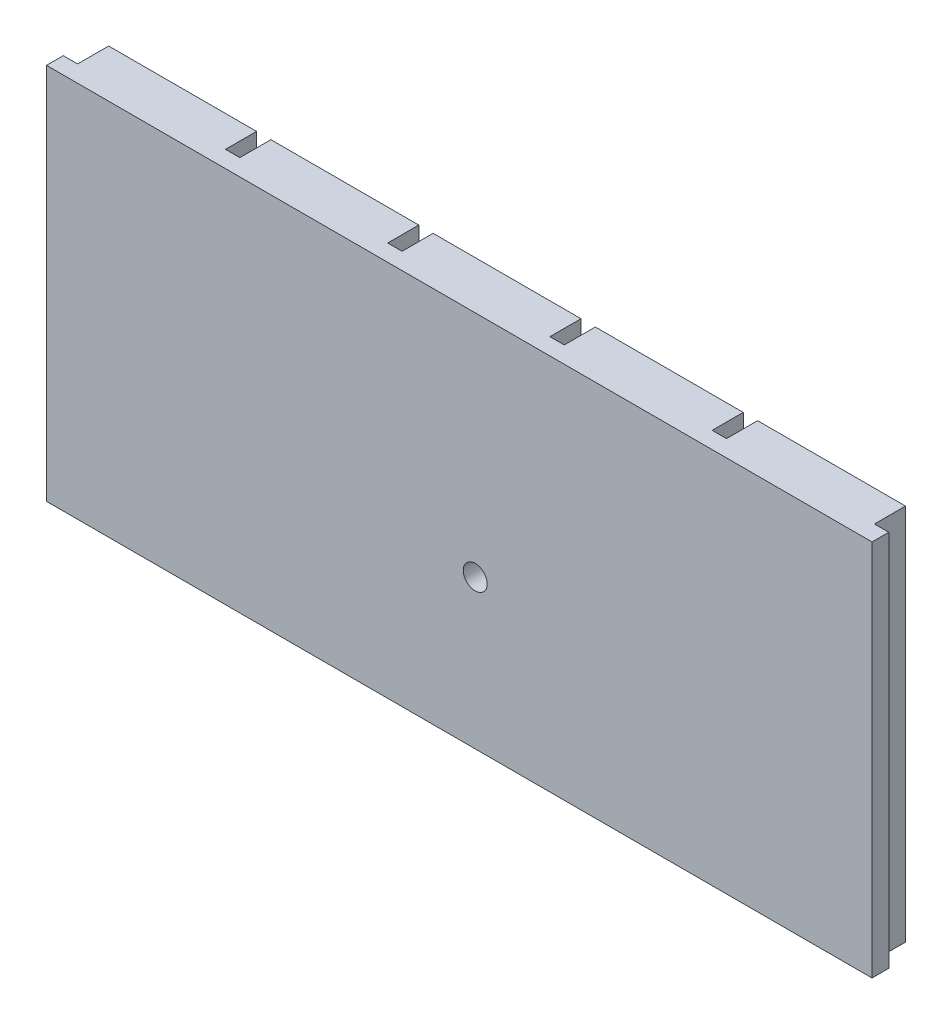
ISO-10303-21;
HEADER;
FILE_DESCRIPTION(('STEP AP214'),'2;1');
FILE_NAME('part.step','',(''),(''),'','','');
FILE_SCHEMA(('AUTOMOTIVE_DESIGN { 1 0 10303 214 1 1 1 1 }'));
ENDSEC;
DATA;
#1=APPLICATION_CONTEXT('core data for automotive mechanical design processes');
#2=APPLICATION_PROTOCOL_DEFINITION('international standard','automotive_design',2000,#1);
#3=PRODUCT_CONTEXT('',#1,'mechanical');
#4=PRODUCT('Part','Part','',(#3));
#5=PRODUCT_RELATED_PRODUCT_CATEGORY('part','',(#4));
#6=PRODUCT_DEFINITION_FORMATION('','',#4);
#7=PRODUCT_DEFINITION_CONTEXT('part definition',#1,'design');
#8=PRODUCT_DEFINITION('design','',#6,#7);
#9=PRODUCT_DEFINITION_SHAPE('','',#8);
#10=(LENGTH_UNIT() NAMED_UNIT(*) SI_UNIT(.MILLI.,.METRE.));
#11=(NAMED_UNIT(*) PLANE_ANGLE_UNIT() SI_UNIT($,.RADIAN.));
#12=(NAMED_UNIT(*) SI_UNIT($,.STERADIAN.) SOLID_ANGLE_UNIT());
#13=UNCERTAINTY_MEASURE_WITH_UNIT(LENGTH_MEASURE(1.E-05),#10,'distance_accuracy_value','');
#14=(GEOMETRIC_REPRESENTATION_CONTEXT(3) GLOBAL_UNCERTAINTY_ASSIGNED_CONTEXT((#13)) GLOBAL_UNIT_ASSIGNED_CONTEXT((#10,
#11,#12)) REPRESENTATION_CONTEXT('',''));
#15=CARTESIAN_POINT('',(0.,0.,0.));
#16=DIRECTION('',(0.,0.,1.));
#17=DIRECTION('',(1.,0.,0.));
#18=AXIS2_PLACEMENT_3D('',#15,#16,#17);
#19=CARTESIAN_POINT('',(0.,0.,0.));
#20=DIRECTION('',(0.,0.,-1.));
#21=DIRECTION('',(-1.,0.,0.));
#22=AXIS2_PLACEMENT_3D('',#19,#20,#21);
#23=PLANE('',#22);
#24=DIRECTION('',(0.,1.,0.));
#25=VECTOR('',#24,1.);
#26=CARTESIAN_POINT('',(-49.4064909033683,-39.501,9.47941669413857E-13));
#27=LINE('',#26,#25);
#28=CARTESIAN_POINT('',(-49.4064909033683,-39.4999999999999,9.47941669413857E-13));
#29=VERTEX_POINT('',#28);
#30=CARTESIAN_POINT('',(-49.4064909033683,39.4999999999999,9.47941669413857E-13));
#31=VERTEX_POINT('',#30);
#32=EDGE_CURVE('E342',#29,#31,#27,.T.);
#33=ORIENTED_EDGE('',*,*,#32,.T.);
#34=DIRECTION('',(-1.,0.,0.));
#35=VECTOR('',#34,1.);
#36=CARTESIAN_POINT('',(-86.3441515056138,39.4999999999999,0.));
#37=LINE('',#36,#35);
#38=CARTESIAN_POINT('',(-18.4688303011228,39.4999999999999,7.11507343120009E-13));
#39=VERTEX_POINT('',#38);
#40=EDGE_CURVE('E377',#39,#31,#37,.T.);
#41=ORIENTED_EDGE('',*,*,#40,.F.);
#42=DIRECTION('',(0.,1.,0.));
#43=VECTOR('',#42,1.);
#44=CARTESIAN_POINT('',(-18.4688303011228,-39.501,7.11507343120009E-13));
#45=LINE('',#44,#43);
#46=CARTESIAN_POINT('',(-18.4688303011228,-39.4999999999999,0.));
#47=VERTEX_POINT('',#46);
#48=EDGE_CURVE('E318',#47,#39,#45,.T.);
#49=ORIENTED_EDGE('',*,*,#48,.F.);
#50=DIRECTION('',(1.,0.,0.));
#51=VECTOR('',#50,1.);
#52=CARTESIAN_POINT('',(-86.3441515056138,-39.4999999999999,0.));
#53=LINE('',#52,#51);
#54=EDGE_CURVE('E228',#29,#47,#53,.T.);
#55=ORIENTED_EDGE('',*,*,#54,.F.);
#56=EDGE_LOOP('',(#33,#41,#49,#55));
#57=FACE_BOUND('',#56,.T.);
#58=ADVANCED_FACE('F35',(#57),#23,.T.);
#59=DIRECTION('',(0.,1.,0.));
#60=VECTOR('',#59,1.);
#61=CARTESIAN_POINT('',(-15.4688303011228,-39.501,7.10956252060392E-13));
#62=LINE('',#61,#60);
#63=CARTESIAN_POINT('',(-15.4688303011228,-39.4999999999999,7.10956252060392E-13));
#64=VERTEX_POINT('',#63);
#65=CARTESIAN_POINT('',(-15.4688303011228,39.4999999999999,7.10956252060392E-13));
#66=VERTEX_POINT('',#65);
#67=EDGE_CURVE('E317',#64,#66,#62,.T.);
#68=ORIENTED_EDGE('',*,*,#67,.T.);
#69=CARTESIAN_POINT('',(15.4688303011228,39.4999999999999,4.74521925766545E-13));
#70=VERTEX_POINT('',#69);
#71=EDGE_CURVE('E379',#70,#66,#37,.T.);
#72=ORIENTED_EDGE('',*,*,#71,.F.);
#73=DIRECTION('',(0.,1.,0.));
#74=VECTOR('',#73,1.);
#75=CARTESIAN_POINT('',(15.4688303011228,-39.501,4.74521925766545E-13));
#76=LINE('',#75,#74);
#77=CARTESIAN_POINT('',(15.4688303011228,-39.4999999999999,0.));
#78=VERTEX_POINT('',#77);
#79=EDGE_CURVE('E293',#78,#70,#76,.T.);
#80=ORIENTED_EDGE('',*,*,#79,.F.);
#81=EDGE_CURVE('E416',#64,#78,#53,.T.);
#82=ORIENTED_EDGE('',*,*,#81,.F.);
#83=EDGE_LOOP('',(#68,#72,#80,#82));
#84=FACE_BOUND('',#83,.T.);
#85=CARTESIAN_POINT('',(3.3372047050014,-8.38677821628897,0.));
#86=DIRECTION('',(0.,0.,1.));
#87=DIRECTION('',(1.,0.,0.));
#88=AXIS2_PLACEMENT_3D('',#85,#86,#87);
#89=CIRCLE('',#88,2.5);
#90=CARTESIAN_POINT('',(5.8372047050014,-8.38677821628897,0.));
#91=VERTEX_POINT('',#90);
#92=EDGE_CURVE('E241',#91,#91,#89,.T.);
#93=ORIENTED_EDGE('',*,*,#92,.T.);
#94=EDGE_LOOP('',(#93));
#95=FACE_BOUND('',#94,.T.);
#96=ADVANCED_FACE('F413',(#84,#95),#23,.T.);
#97=DIRECTION('',(0.,1.,0.));
#98=VECTOR('',#97,1.);
#99=CARTESIAN_POINT('',(18.4688303011228,-39.501,4.73970834706928E-13));
#100=LINE('',#99,#98);
#101=CARTESIAN_POINT('',(18.4688303011228,-39.4999999999999,4.73970834706928E-13));
#102=VERTEX_POINT('',#101);
#103=CARTESIAN_POINT('',(18.4688303011228,39.4999999999999,4.73970834706928E-13));
#104=VERTEX_POINT('',#103);
#105=EDGE_CURVE('E292',#102,#104,#100,.T.);
#106=ORIENTED_EDGE('',*,*,#105,.T.);
#107=CARTESIAN_POINT('',(49.4064909033683,39.4999999999999,2.3753650841308E-13));
#108=VERTEX_POINT('',#107);
#109=EDGE_CURVE('E233',#108,#104,#37,.T.);
#110=ORIENTED_EDGE('',*,*,#109,.F.);
#111=DIRECTION('',(0.,1.,0.));
#112=VECTOR('',#111,1.);
#113=CARTESIAN_POINT('',(49.4064909033683,-39.501,2.3753650841308E-13));
#114=LINE('',#113,#112);
#115=CARTESIAN_POINT('',(49.4064909033683,-39.4999999999999,0.));
#116=VERTEX_POINT('',#115);
#117=EDGE_CURVE('E268',#116,#108,#114,.T.);
#118=ORIENTED_EDGE('',*,*,#117,.F.);
#119=EDGE_CURVE('E397',#102,#116,#53,.T.);
#120=ORIENTED_EDGE('',*,*,#119,.F.);
#121=EDGE_LOOP('',(#106,#110,#118,#120));
#122=FACE_BOUND('',#121,.T.);
#123=ADVANCED_FACE('F395',(#122),#23,.T.);
#124=DIRECTION('',(0.,1.,0.));
#125=VECTOR('',#124,1.);
#126=CARTESIAN_POINT('',(52.4064909033683,-39.501,2.36985417353464E-13));
#127=LINE('',#126,#125);
#128=CARTESIAN_POINT('',(52.4064909033683,-39.4999999999999,2.36985417353464E-13));
#129=VERTEX_POINT('',#128);
#130=CARTESIAN_POINT('',(52.4064909033683,39.4999999999999,2.36985417353464E-13));
#131=VERTEX_POINT('',#130);
#132=EDGE_CURVE('E267',#129,#131,#127,.T.);
#133=ORIENTED_EDGE('',*,*,#132,.T.);
#134=CARTESIAN_POINT('',(83.3441515056138,39.4999999999999,0.));
#135=VERTEX_POINT('',#134);
#136=EDGE_CURVE('E230',#135,#131,#37,.T.);
#137=ORIENTED_EDGE('',*,*,#136,.F.);
#138=DIRECTION('',(0.,1.,0.));
#139=VECTOR('',#138,1.);
#140=CARTESIAN_POINT('',(83.3441515056138,-39.501,0.));
#141=LINE('',#140,#139);
#142=CARTESIAN_POINT('',(83.3441515056138,-39.4999999999999,0.));
#143=VERTEX_POINT('',#142);
#144=EDGE_CURVE('E251',#143,#135,#141,.T.);
#145=ORIENTED_EDGE('',*,*,#144,.F.);
#146=EDGE_CURVE('E229',#129,#143,#53,.T.);
#147=ORIENTED_EDGE('',*,*,#146,.F.);
#148=EDGE_LOOP('',(#133,#137,#145,#147));
#149=FACE_BOUND('',#148,.T.);
#150=ADVANCED_FACE('F455',(#149),#23,.T.);
#151=CARTESIAN_POINT('',(0.,0.,10.));
#152=DIRECTION('',(0.,0.,-1.));
#153=DIRECTION('',(-1.,0.,0.));
#154=AXIS2_PLACEMENT_3D('',#151,#152,#153);
#155=PLANE('',#154);
#156=DIRECTION('',(0.,1.,0.));
#157=VECTOR('',#156,1.);
#158=CARTESIAN_POINT('',(86.3441515056138,-39.4999999999999,10.));
#159=LINE('',#158,#157);
#160=CARTESIAN_POINT('',(86.3441515056138,-39.4999999999999,10.));
#161=VERTEX_POINT('',#160);
#162=CARTESIAN_POINT('',(86.3441515056138,39.4999999999999,10.));
#163=VERTEX_POINT('',#162);
#164=EDGE_CURVE('E227',#161,#163,#159,.T.);
#165=ORIENTED_EDGE('',*,*,#164,.T.);
#166=DIRECTION('',(-1.,0.,0.));
#167=VECTOR('',#166,1.);
#168=CARTESIAN_POINT('',(-86.3441515056138,39.4999999999999,10.));
#169=LINE('',#168,#167);
#170=CARTESIAN_POINT('',(-86.3441515056138,39.4999999999999,10.));
#171=VERTEX_POINT('',#170);
#172=EDGE_CURVE('E237',#163,#171,#169,.T.);
#173=ORIENTED_EDGE('',*,*,#172,.T.);
#174=DIRECTION('',(0.,-1.,0.));
#175=VECTOR('',#174,1.);
#176=CARTESIAN_POINT('',(-86.3441515056138,-39.4999999999999,10.));
#177=LINE('',#176,#175);
#178=CARTESIAN_POINT('',(-86.3441515056138,-39.4999999999999,10.));
#179=VERTEX_POINT('',#178);
#180=EDGE_CURVE('E217',#171,#179,#177,.T.);
#181=ORIENTED_EDGE('',*,*,#180,.T.);
#182=DIRECTION('',(1.,0.,0.));
#183=VECTOR('',#182,1.);
#184=CARTESIAN_POINT('',(-86.3441515056138,-39.4999999999999,10.));
#185=LINE('',#184,#183);
#186=EDGE_CURVE('E224',#179,#161,#185,.T.);
#187=ORIENTED_EDGE('',*,*,#186,.T.);
#188=EDGE_LOOP('',(#165,#173,#181,#187));
#189=FACE_BOUND('',#188,.T.);
#190=CARTESIAN_POINT('',(3.3372047050014,-8.38677821628897,10.));
#191=DIRECTION('',(0.,0.,1.));
#192=DIRECTION('',(1.,0.,0.));
#193=AXIS2_PLACEMENT_3D('',#190,#191,#192);
#194=CIRCLE('',#193,2.5);
#195=CARTESIAN_POINT('',(5.8372047050014,-8.38677821628897,10.));
#196=VERTEX_POINT('',#195);
#197=EDGE_CURVE('E244',#196,#196,#194,.T.);
#198=ORIENTED_EDGE('',*,*,#197,.F.);
#199=EDGE_LOOP('',(#198));
#200=FACE_BOUND('',#199,.T.);
#201=ADVANCED_FACE('F454',(#189,#200),#155,.F.);
#202=DIRECTION('',(0.,1.,0.));
#203=VECTOR('',#202,1.);
#204=CARTESIAN_POINT('',(-83.3441515056138,-39.501,1.18492708676732E-12));
#205=LINE('',#204,#203);
#206=CARTESIAN_POINT('',(-83.3441515056138,-39.4999999999999,1.18492708676732E-12));
#207=VERTEX_POINT('',#206);
#208=CARTESIAN_POINT('',(-83.3441515056138,39.4999999999999,1.18492708676732E-12));
#209=VERTEX_POINT('',#208);
#210=EDGE_CURVE('E362',#207,#209,#205,.T.);
#211=ORIENTED_EDGE('',*,*,#210,.T.);
#212=CARTESIAN_POINT('',(-52.4064909033683,39.4999999999999,9.48492760473473E-13));
#213=VERTEX_POINT('',#212);
#214=EDGE_CURVE('E234',#213,#209,#37,.T.);
#215=ORIENTED_EDGE('',*,*,#214,.F.);
#216=DIRECTION('',(0.,1.,0.));
#217=VECTOR('',#216,1.);
#218=CARTESIAN_POINT('',(-52.4064909033683,-39.501,9.48492760473473E-13));
#219=LINE('',#218,#217);
#220=CARTESIAN_POINT('',(-52.4064909033683,-39.4999999999999,0.));
#221=VERTEX_POINT('',#220);
#222=EDGE_CURVE('E343',#221,#213,#219,.T.);
#223=ORIENTED_EDGE('',*,*,#222,.F.);
#224=EDGE_CURVE('E225',#207,#221,#53,.T.);
#225=ORIENTED_EDGE('',*,*,#224,.F.);
#226=EDGE_LOOP('',(#211,#215,#223,#225));
#227=FACE_BOUND('',#226,.T.);
#228=ADVANCED_FACE('F373',(#227),#23,.T.);
#229=CARTESIAN_POINT('',(86.3441515056138,-39.4999999999999,10.));
#230=DIRECTION('',(-1.,0.,0.));
#231=DIRECTION('',(0.,-1.,0.));
#232=AXIS2_PLACEMENT_3D('',#229,#230,#231);
#233=PLANE('',#232);
#234=DIRECTION('',(0.,0.,-1.));
#235=VECTOR('',#234,1.);
#236=CARTESIAN_POINT('',(86.3441515056138,-39.4999999999999,10.));
#237=LINE('',#236,#235);
#238=CARTESIAN_POINT('',(86.3441515056138,-39.4999999999999,6.5));
#239=VERTEX_POINT('',#238);
#240=EDGE_CURVE('E219',#161,#239,#237,.T.);
#241=ORIENTED_EDGE('',*,*,#240,.T.);
#242=DIRECTION('',(0.,1.,0.));
#243=VECTOR('',#242,1.);
#244=CARTESIAN_POINT('',(86.3441515056138,-39.501,6.5));
#245=LINE('',#244,#243);
#246=CARTESIAN_POINT('',(86.3441515056138,39.4999999999999,6.5));
#247=VERTEX_POINT('',#246);
#248=EDGE_CURVE('E250',#239,#247,#245,.T.);
#249=ORIENTED_EDGE('',*,*,#248,.T.);
#250=DIRECTION('',(0.,0.,-1.));
#251=VECTOR('',#250,1.);
#252=CARTESIAN_POINT('',(86.3441515056138,39.4999999999999,10.));
#253=LINE('',#252,#251);
#254=EDGE_CURVE('E11',#163,#247,#253,.T.);
#255=ORIENTED_EDGE('',*,*,#254,.F.);
#256=ORIENTED_EDGE('',*,*,#164,.F.);
#257=EDGE_LOOP('',(#241,#249,#255,#256));
#258=FACE_BOUND('',#257,.T.);
#259=ADVANCED_FACE('F37',(#258),#233,.F.);
#260=CARTESIAN_POINT('',(-86.3441515056138,39.4999999999999,10.));
#261=DIRECTION('',(0.,-1.,0.));
#262=DIRECTION('',(1.,0.,0.));
#263=AXIS2_PLACEMENT_3D('',#260,#261,#262);
#264=PLANE('',#263);
#265=ORIENTED_EDGE('',*,*,#214,.T.);
#266=DIRECTION('',(0.,0.,-1.));
#267=VECTOR('',#266,1.);
#268=CARTESIAN_POINT('',(-83.3441515056138,39.4999999999999,1.18492708676732E-12));
#269=LINE('',#268,#267);
#270=CARTESIAN_POINT('',(-83.3441515056138,39.4999999999999,6.50000000000118));
#271=VERTEX_POINT('',#270);
#272=EDGE_CURVE('E208',#271,#209,#269,.T.);
#273=ORIENTED_EDGE('',*,*,#272,.F.);
#274=DIRECTION('',(1.,0.,0.));
#275=VECTOR('',#274,1.);
#276=CARTESIAN_POINT('',(-83.3441515056138,39.4999999999999,6.50000000000118));
#277=LINE('',#276,#275);
#278=CARTESIAN_POINT('',(-86.3441515056138,39.4999999999999,6.50000000000118));
#279=VERTEX_POINT('',#278);
#280=EDGE_CURVE('E199',#279,#271,#277,.T.);
#281=ORIENTED_EDGE('',*,*,#280,.F.);
#282=DIRECTION('',(0.,0.,-1.));
#283=VECTOR('',#282,1.);
#284=CARTESIAN_POINT('',(-86.3441515056138,39.4999999999999,10.));
#285=LINE('',#284,#283);
#286=EDGE_CURVE('E43',#171,#279,#285,.T.);
#287=ORIENTED_EDGE('',*,*,#286,.F.);
#288=ORIENTED_EDGE('',*,*,#172,.F.);
#289=ORIENTED_EDGE('',*,*,#254,.T.);
#290=DIRECTION('',(1.,0.,0.));
#291=VECTOR('',#290,1.);
#292=CARTESIAN_POINT('',(86.3441515056138,39.4999999999999,6.5));
#293=LINE('',#292,#291);
#294=CARTESIAN_POINT('',(83.3441515056138,39.4999999999999,6.5));
#295=VERTEX_POINT('',#294);
#296=EDGE_CURVE('E254',#295,#247,#293,.T.);
#297=ORIENTED_EDGE('',*,*,#296,.F.);
#298=DIRECTION('',(0.,0.,1.));
#299=VECTOR('',#298,1.);
#300=CARTESIAN_POINT('',(83.3441515056138,39.4999999999999,0.));
#301=LINE('',#300,#299);
#302=EDGE_CURVE('E259',#135,#295,#301,.T.);
#303=ORIENTED_EDGE('',*,*,#302,.F.);
#304=ORIENTED_EDGE('',*,*,#136,.T.);
#305=DIRECTION('',(0.,0.,-1.));
#306=VECTOR('',#305,1.);
#307=CARTESIAN_POINT('',(52.4064909033683,39.4999999999999,2.36985417353464E-13));
#308=LINE('',#307,#306);
#309=CARTESIAN_POINT('',(52.4064909033683,39.4999999999999,6.50000000000024));
#310=VERTEX_POINT('',#309);
#311=EDGE_CURVE('E271',#310,#131,#308,.T.);
#312=ORIENTED_EDGE('',*,*,#311,.F.);
#313=DIRECTION('',(1.,0.,0.));
#314=VECTOR('',#313,1.);
#315=CARTESIAN_POINT('',(52.4064909033683,39.4999999999999,6.50000000000024));
#316=LINE('',#315,#314);
#317=CARTESIAN_POINT('',(49.4064909033683,39.4999999999999,6.50000000000024));
#318=VERTEX_POINT('',#317);
#319=EDGE_CURVE('E278',#318,#310,#316,.T.);
#320=ORIENTED_EDGE('',*,*,#319,.F.);
#321=DIRECTION('',(0.,0.,1.));
#322=VECTOR('',#321,1.);
#323=CARTESIAN_POINT('',(49.4064909033683,39.4999999999999,2.3753650841308E-13));
#324=LINE('',#323,#322);
#325=EDGE_CURVE('E281',#108,#318,#324,.T.);
#326=ORIENTED_EDGE('',*,*,#325,.F.);
#327=ORIENTED_EDGE('',*,*,#109,.T.);
#328=DIRECTION('',(0.,0.,-1.));
#329=VECTOR('',#328,1.);
#330=CARTESIAN_POINT('',(18.4688303011228,39.4999999999999,4.73970834706928E-13));
#331=LINE('',#330,#329);
#332=CARTESIAN_POINT('',(18.4688303011228,39.4999999999999,6.50000000000047));
#333=VERTEX_POINT('',#332);
#334=EDGE_CURVE('E296',#333,#104,#331,.T.);
#335=ORIENTED_EDGE('',*,*,#334,.F.);
#336=DIRECTION('',(1.,0.,0.));
#337=VECTOR('',#336,1.);
#338=CARTESIAN_POINT('',(18.4688303011228,39.4999999999999,6.50000000000047));
#339=LINE('',#338,#337);
#340=CARTESIAN_POINT('',(15.4688303011228,39.4999999999999,6.50000000000047));
#341=VERTEX_POINT('',#340);
#342=EDGE_CURVE('E303',#341,#333,#339,.T.);
#343=ORIENTED_EDGE('',*,*,#342,.F.);
#344=DIRECTION('',(0.,0.,1.));
#345=VECTOR('',#344,1.);
#346=CARTESIAN_POINT('',(15.4688303011228,39.4999999999999,4.74521925766545E-13));
#347=LINE('',#346,#345);
#348=EDGE_CURVE('E306',#70,#341,#347,.T.);
#349=ORIENTED_EDGE('',*,*,#348,.F.);
#350=ORIENTED_EDGE('',*,*,#71,.T.);
#351=DIRECTION('',(0.,0.,-1.));
#352=VECTOR('',#351,1.);
#353=CARTESIAN_POINT('',(-15.4688303011228,39.4999999999999,7.10956252060392E-13));
#354=LINE('',#353,#352);
#355=CARTESIAN_POINT('',(-15.4688303011228,39.4999999999999,6.50000000000071));
#356=VERTEX_POINT('',#355);
#357=EDGE_CURVE('E321',#356,#66,#354,.T.);
#358=ORIENTED_EDGE('',*,*,#357,.F.);
#359=DIRECTION('',(1.,0.,0.));
#360=VECTOR('',#359,1.);
#361=CARTESIAN_POINT('',(-15.4688303011228,39.4999999999999,6.50000000000071));
#362=LINE('',#361,#360);
#363=CARTESIAN_POINT('',(-18.4688303011228,39.4999999999999,6.50000000000071));
#364=VERTEX_POINT('',#363);
#365=EDGE_CURVE('E328',#364,#356,#362,.T.);
#366=ORIENTED_EDGE('',*,*,#365,.F.);
#367=DIRECTION('',(0.,0.,1.));
#368=VECTOR('',#367,1.);
#369=CARTESIAN_POINT('',(-18.4688303011228,39.4999999999999,7.11507343120009E-13));
#370=LINE('',#369,#368);
#371=EDGE_CURVE('E331',#39,#364,#370,.T.);
#372=ORIENTED_EDGE('',*,*,#371,.F.);
#373=ORIENTED_EDGE('',*,*,#40,.T.);
#374=DIRECTION('',(0.,0.,-1.));
#375=VECTOR('',#374,1.);
#376=CARTESIAN_POINT('',(-49.4064909033683,39.4999999999999,9.47941669413857E-13));
#377=LINE('',#376,#375);
#378=CARTESIAN_POINT('',(-49.4064909033683,39.4999999999999,6.50000000000095));
#379=VERTEX_POINT('',#378);
#380=EDGE_CURVE('E346',#379,#31,#377,.T.);
#381=ORIENTED_EDGE('',*,*,#380,.F.);
#382=DIRECTION('',(1.,0.,0.));
#383=VECTOR('',#382,1.);
#384=CARTESIAN_POINT('',(-49.4064909033683,39.4999999999999,6.50000000000095));
#385=LINE('',#384,#383);
#386=CARTESIAN_POINT('',(-52.4064909033683,39.4999999999999,6.50000000000095));
#387=VERTEX_POINT('',#386);
#388=EDGE_CURVE('E353',#387,#379,#385,.T.);
#389=ORIENTED_EDGE('',*,*,#388,.F.);
#390=DIRECTION('',(0.,0.,1.));
#391=VECTOR('',#390,1.);
#392=CARTESIAN_POINT('',(-52.4064909033683,39.4999999999999,9.48492760473473E-13));
#393=LINE('',#392,#391);
#394=EDGE_CURVE('E356',#213,#387,#393,.T.);
#395=ORIENTED_EDGE('',*,*,#394,.F.);
#396=EDGE_LOOP('',(#265,#273,#281,#287,#288,#289,#297,#303,#304,#312,#320,#326,#327,#335,#343,
#349,#350,#358,#366,#372,#373,#381,#389,#395));
#397=FACE_BOUND('',#396,.T.);
#398=ADVANCED_FACE('F213',(#397),#264,.F.);
#399=CARTESIAN_POINT('',(-86.3441515056138,-39.4999999999999,10.));
#400=DIRECTION('',(1.,0.,0.));
#401=DIRECTION('',(0.,1.,0.));
#402=AXIS2_PLACEMENT_3D('',#399,#400,#401);
#403=PLANE('',#402);
#404=ORIENTED_EDGE('',*,*,#286,.T.);
#405=DIRECTION('',(0.,1.,0.));
#406=VECTOR('',#405,1.);
#407=CARTESIAN_POINT('',(-86.3441515056138,-39.501,6.50000000000118));
#408=LINE('',#407,#406);
#409=CARTESIAN_POINT('',(-86.3441515056138,-39.4999999999999,6.50000000000118));
#410=VERTEX_POINT('',#409);
#411=EDGE_CURVE('E196',#410,#279,#408,.T.);
#412=ORIENTED_EDGE('',*,*,#411,.F.);
#413=DIRECTION('',(0.,0.,-1.));
#414=VECTOR('',#413,1.);
#415=CARTESIAN_POINT('',(-86.3441515056138,-39.4999999999999,10.));
#416=LINE('',#415,#414);
#417=EDGE_CURVE('E218',#179,#410,#416,.T.);
#418=ORIENTED_EDGE('',*,*,#417,.F.);
#419=ORIENTED_EDGE('',*,*,#180,.F.);
#420=EDGE_LOOP('',(#404,#412,#418,#419));
#421=FACE_BOUND('',#420,.T.);
#422=ADVANCED_FACE('F216',(#421),#403,.F.);
#423=CARTESIAN_POINT('',(-86.3441515056138,-39.4999999999999,10.));
#424=DIRECTION('',(0.,1.,0.));
#425=DIRECTION('',(0.,0.,1.));
#426=AXIS2_PLACEMENT_3D('',#423,#424,#425);
#427=PLANE('',#426);
#428=DIRECTION('',(-1.,0.,0.));
#429=VECTOR('',#428,1.);
#430=CARTESIAN_POINT('',(-83.3441515056138,-39.4999999999999,6.50000000000118));
#431=LINE('',#430,#429);
#432=CARTESIAN_POINT('',(-83.3441515056138,-39.4999999999999,6.50000000000118));
#433=VERTEX_POINT('',#432);
#434=EDGE_CURVE('E202',#433,#410,#431,.T.);
#435=ORIENTED_EDGE('',*,*,#434,.F.);
#436=DIRECTION('',(0.,0.,1.));
#437=VECTOR('',#436,1.);
#438=CARTESIAN_POINT('',(-83.3441515056138,-39.4999999999999,1.18492708676732E-12));
#439=LINE('',#438,#437);
#440=EDGE_CURVE('E50',#207,#433,#439,.T.);
#441=ORIENTED_EDGE('',*,*,#440,.F.);
#442=ORIENTED_EDGE('',*,*,#224,.T.);
#443=DIRECTION('',(0.,0.,-1.));
#444=VECTOR('',#443,1.);
#445=CARTESIAN_POINT('',(-52.4064909033683,-39.4999999999999,9.48492760473473E-13));
#446=LINE('',#445,#444);
#447=CARTESIAN_POINT('',(-52.4064909033683,-39.4999999999999,6.50000000000095));
#448=VERTEX_POINT('',#447);
#449=EDGE_CURVE('E339',#448,#221,#446,.T.);
#450=ORIENTED_EDGE('',*,*,#449,.F.);
#451=DIRECTION('',(-1.,0.,0.));
#452=VECTOR('',#451,1.);
#453=CARTESIAN_POINT('',(-49.4064909033683,-39.4999999999999,6.50000000000095));
#454=LINE('',#453,#452);
#455=CARTESIAN_POINT('',(-49.4064909033683,-39.4999999999999,6.50000000000095));
#456=VERTEX_POINT('',#455);
#457=EDGE_CURVE('E58',#456,#448,#454,.T.);
#458=ORIENTED_EDGE('',*,*,#457,.F.);
#459=DIRECTION('',(0.,0.,1.));
#460=VECTOR('',#459,1.);
#461=CARTESIAN_POINT('',(-49.4064909033683,-39.4999999999999,9.47941669413857E-13));
#462=LINE('',#461,#460);
#463=EDGE_CURVE('E359',#29,#456,#462,.T.);
#464=ORIENTED_EDGE('',*,*,#463,.F.);
#465=ORIENTED_EDGE('',*,*,#54,.T.);
#466=DIRECTION('',(0.,0.,-1.));
#467=VECTOR('',#466,1.);
#468=CARTESIAN_POINT('',(-18.4688303011228,-39.4999999999999,7.11507343120009E-13));
#469=LINE('',#468,#467);
#470=CARTESIAN_POINT('',(-18.4688303011228,-39.4999999999999,6.50000000000071));
#471=VERTEX_POINT('',#470);
#472=EDGE_CURVE('E314',#471,#47,#469,.T.);
#473=ORIENTED_EDGE('',*,*,#472,.F.);
#474=DIRECTION('',(-1.,0.,0.));
#475=VECTOR('',#474,1.);
#476=CARTESIAN_POINT('',(-15.4688303011228,-39.4999999999999,6.50000000000071));
#477=LINE('',#476,#475);
#478=CARTESIAN_POINT('',(-15.4688303011228,-39.4999999999999,6.50000000000071));
#479=VERTEX_POINT('',#478);
#480=EDGE_CURVE('E337',#479,#471,#477,.T.);
#481=ORIENTED_EDGE('',*,*,#480,.F.);
#482=DIRECTION('',(0.,0.,1.));
#483=VECTOR('',#482,1.);
#484=CARTESIAN_POINT('',(-15.4688303011228,-39.4999999999999,7.10956252060392E-13));
#485=LINE('',#484,#483);
#486=EDGE_CURVE('E334',#64,#479,#485,.T.);
#487=ORIENTED_EDGE('',*,*,#486,.F.);
#488=ORIENTED_EDGE('',*,*,#81,.T.);
#489=DIRECTION('',(0.,0.,-1.));
#490=VECTOR('',#489,1.);
#491=CARTESIAN_POINT('',(15.4688303011228,-39.4999999999999,4.74521925766545E-13));
#492=LINE('',#491,#490);
#493=CARTESIAN_POINT('',(15.4688303011228,-39.4999999999999,6.50000000000047));
#494=VERTEX_POINT('',#493);
#495=EDGE_CURVE('E289',#494,#78,#492,.T.);
#496=ORIENTED_EDGE('',*,*,#495,.F.);
#497=DIRECTION('',(-1.,0.,0.));
#498=VECTOR('',#497,1.);
#499=CARTESIAN_POINT('',(18.4688303011228,-39.4999999999999,6.50000000000047));
#500=LINE('',#499,#498);
#501=CARTESIAN_POINT('',(18.4688303011228,-39.4999999999999,6.50000000000047));
#502=VERTEX_POINT('',#501);
#503=EDGE_CURVE('E312',#502,#494,#500,.T.);
#504=ORIENTED_EDGE('',*,*,#503,.F.);
#505=DIRECTION('',(0.,0.,1.));
#506=VECTOR('',#505,1.);
#507=CARTESIAN_POINT('',(18.4688303011228,-39.4999999999999,4.73970834706928E-13));
#508=LINE('',#507,#506);
#509=EDGE_CURVE('E309',#102,#502,#508,.T.);
#510=ORIENTED_EDGE('',*,*,#509,.F.);
#511=ORIENTED_EDGE('',*,*,#119,.T.);
#512=DIRECTION('',(0.,0.,-1.));
#513=VECTOR('',#512,1.);
#514=CARTESIAN_POINT('',(49.4064909033683,-39.4999999999999,2.3753650841308E-13));
#515=LINE('',#514,#513);
#516=CARTESIAN_POINT('',(49.4064909033683,-39.4999999999999,6.50000000000024));
#517=VERTEX_POINT('',#516);
#518=EDGE_CURVE('E264',#517,#116,#515,.T.);
#519=ORIENTED_EDGE('',*,*,#518,.F.);
#520=DIRECTION('',(-1.,0.,0.));
#521=VECTOR('',#520,1.);
#522=CARTESIAN_POINT('',(52.4064909033683,-39.4999999999999,6.50000000000024));
#523=LINE('',#522,#521);
#524=CARTESIAN_POINT('',(52.4064909033683,-39.4999999999999,6.50000000000024));
#525=VERTEX_POINT('',#524);
#526=EDGE_CURVE('E287',#525,#517,#523,.T.);
#527=ORIENTED_EDGE('',*,*,#526,.F.);
#528=DIRECTION('',(0.,0.,1.));
#529=VECTOR('',#528,1.);
#530=CARTESIAN_POINT('',(52.4064909033683,-39.4999999999999,2.36985417353464E-13));
#531=LINE('',#530,#529);
#532=EDGE_CURVE('E284',#129,#525,#531,.T.);
#533=ORIENTED_EDGE('',*,*,#532,.F.);
#534=ORIENTED_EDGE('',*,*,#146,.T.);
#535=DIRECTION('',(0.,0.,-1.));
#536=VECTOR('',#535,1.);
#537=CARTESIAN_POINT('',(83.3441515056138,-39.4999999999999,0.));
#538=LINE('',#537,#536);
#539=CARTESIAN_POINT('',(83.3441515056138,-39.4999999999999,6.5));
#540=VERTEX_POINT('',#539);
#541=EDGE_CURVE('E245',#540,#143,#538,.T.);
#542=ORIENTED_EDGE('',*,*,#541,.F.);
#543=DIRECTION('',(-1.,0.,0.));
#544=VECTOR('',#543,1.);
#545=CARTESIAN_POINT('',(86.3441515056138,-39.4999999999999,6.5));
#546=LINE('',#545,#544);
#547=EDGE_CURVE('E262',#239,#540,#546,.T.);
#548=ORIENTED_EDGE('',*,*,#547,.F.);
#549=ORIENTED_EDGE('',*,*,#240,.F.);
#550=ORIENTED_EDGE('',*,*,#186,.F.);
#551=ORIENTED_EDGE('',*,*,#417,.T.);
#552=EDGE_LOOP('',(#435,#441,#442,#450,#458,#464,#465,#473,#481,#487,#488,#496,#504,#510,#511,
#519,#527,#533,#534,#542,#548,#549,#550,#551));
#553=FACE_BOUND('',#552,.T.);
#554=ADVANCED_FACE('F403',(#553),#427,.F.);
#555=CARTESIAN_POINT('',(3.3372047050014,-8.38677821628897,10.));
#556=DIRECTION('',(0.,0.,-1.));
#557=DIRECTION('',(-1.,0.,0.));
#558=AXIS2_PLACEMENT_3D('',#555,#556,#557);
#559=CYLINDRICAL_SURFACE('',#558,2.5);
#560=ORIENTED_EDGE('',*,*,#197,.T.);
#561=EDGE_LOOP('',(#560));
#562=FACE_BOUND('',#561,.T.);
#563=ORIENTED_EDGE('',*,*,#92,.F.);
#564=EDGE_LOOP('',(#563));
#565=FACE_BOUND('',#564,.T.);
#566=ADVANCED_FACE('F501',(#562,#565),#559,.F.);
#567=CARTESIAN_POINT('',(86.3441515056138,-39.501,6.5));
#568=DIRECTION('',(0.,0.,1.));
#569=DIRECTION('',(1.,0.,0.));
#570=AXIS2_PLACEMENT_3D('',#567,#568,#569);
#571=PLANE('',#570);
#572=ORIENTED_EDGE('',*,*,#547,.T.);
#573=DIRECTION('',(0.,1.,0.));
#574=VECTOR('',#573,1.);
#575=CARTESIAN_POINT('',(83.3441515056138,-39.501,6.5));
#576=LINE('',#575,#574);
#577=EDGE_CURVE('E253',#540,#295,#576,.T.);
#578=ORIENTED_EDGE('',*,*,#577,.T.);
#579=ORIENTED_EDGE('',*,*,#296,.T.);
#580=ORIENTED_EDGE('',*,*,#248,.F.);
#581=EDGE_LOOP('',(#572,#578,#579,#580));
#582=FACE_BOUND('',#581,.T.);
#583=ADVANCED_FACE('F498',(#582),#571,.F.);
#584=CARTESIAN_POINT('',(83.3441515056138,-39.501,0.));
#585=DIRECTION('',(-1.,0.,0.));
#586=DIRECTION('',(0.,0.,1.));
#587=AXIS2_PLACEMENT_3D('',#584,#585,#586);
#588=PLANE('',#587);
#589=ORIENTED_EDGE('',*,*,#541,.T.);
#590=ORIENTED_EDGE('',*,*,#144,.T.);
#591=ORIENTED_EDGE('',*,*,#302,.T.);
#592=ORIENTED_EDGE('',*,*,#577,.F.);
#593=EDGE_LOOP('',(#589,#590,#591,#592));
#594=FACE_BOUND('',#593,.T.);
#595=ADVANCED_FACE('F477',(#594),#588,.F.);
#596=CARTESIAN_POINT('',(52.4064909033683,-39.501,2.36985417353464E-13));
#597=DIRECTION('',(1.,0.,0.));
#598=DIRECTION('',(0.,0.,-1.));
#599=AXIS2_PLACEMENT_3D('',#596,#597,#598);
#600=PLANE('',#599);
#601=ORIENTED_EDGE('',*,*,#532,.T.);
#602=DIRECTION('',(0.,1.,0.));
#603=VECTOR('',#602,1.);
#604=CARTESIAN_POINT('',(52.4064909033683,-39.501,6.50000000000024));
#605=LINE('',#604,#603);
#606=EDGE_CURVE('E273',#525,#310,#605,.T.);
#607=ORIENTED_EDGE('',*,*,#606,.T.);
#608=ORIENTED_EDGE('',*,*,#311,.T.);
#609=ORIENTED_EDGE('',*,*,#132,.F.);
#610=EDGE_LOOP('',(#601,#607,#608,#609));
#611=FACE_BOUND('',#610,.T.);
#612=ADVANCED_FACE('F482',(#611),#600,.F.);
#613=CARTESIAN_POINT('',(52.4064909033683,-39.501,6.50000000000024));
#614=DIRECTION('',(0.,0.,1.));
#615=DIRECTION('',(1.,0.,0.));
#616=AXIS2_PLACEMENT_3D('',#613,#614,#615);
#617=PLANE('',#616);
#618=ORIENTED_EDGE('',*,*,#526,.T.);
#619=DIRECTION('',(0.,1.,0.));
#620=VECTOR('',#619,1.);
#621=CARTESIAN_POINT('',(49.4064909033683,-39.501,6.50000000000024));
#622=LINE('',#621,#620);
#623=EDGE_CURVE('E270',#517,#318,#622,.T.);
#624=ORIENTED_EDGE('',*,*,#623,.T.);
#625=ORIENTED_EDGE('',*,*,#319,.T.);
#626=ORIENTED_EDGE('',*,*,#606,.F.);
#627=EDGE_LOOP('',(#618,#624,#625,#626));
#628=FACE_BOUND('',#627,.T.);
#629=ADVANCED_FACE('F484',(#628),#617,.F.);
#630=CARTESIAN_POINT('',(49.4064909033683,-39.501,2.3753650841308E-13));
#631=DIRECTION('',(-1.,0.,0.));
#632=DIRECTION('',(0.,0.,1.));
#633=AXIS2_PLACEMENT_3D('',#630,#631,#632);
#634=PLANE('',#633);
#635=ORIENTED_EDGE('',*,*,#518,.T.);
#636=ORIENTED_EDGE('',*,*,#117,.T.);
#637=ORIENTED_EDGE('',*,*,#325,.T.);
#638=ORIENTED_EDGE('',*,*,#623,.F.);
#639=EDGE_LOOP('',(#635,#636,#637,#638));
#640=FACE_BOUND('',#639,.T.);
#641=ADVANCED_FACE('F487',(#640),#634,.F.);
#642=CARTESIAN_POINT('',(18.4688303011228,-39.501,4.73970834706928E-13));
#643=DIRECTION('',(1.,0.,0.));
#644=DIRECTION('',(0.,0.,-1.));
#645=AXIS2_PLACEMENT_3D('',#642,#643,#644);
#646=PLANE('',#645);
#647=ORIENTED_EDGE('',*,*,#509,.T.);
#648=DIRECTION('',(0.,1.,0.));
#649=VECTOR('',#648,1.);
#650=CARTESIAN_POINT('',(18.4688303011228,-39.501,6.50000000000047));
#651=LINE('',#650,#649);
#652=EDGE_CURVE('E298',#502,#333,#651,.T.);
#653=ORIENTED_EDGE('',*,*,#652,.T.);
#654=ORIENTED_EDGE('',*,*,#334,.T.);
#655=ORIENTED_EDGE('',*,*,#105,.F.);
#656=EDGE_LOOP('',(#647,#653,#654,#655));
#657=FACE_BOUND('',#656,.T.);
#658=ADVANCED_FACE('F400',(#657),#646,.F.);
#659=CARTESIAN_POINT('',(18.4688303011228,-39.501,6.50000000000047));
#660=DIRECTION('',(0.,0.,1.));
#661=DIRECTION('',(1.,0.,0.));
#662=AXIS2_PLACEMENT_3D('',#659,#660,#661);
#663=PLANE('',#662);
#664=ORIENTED_EDGE('',*,*,#503,.T.);
#665=DIRECTION('',(0.,1.,0.));
#666=VECTOR('',#665,1.);
#667=CARTESIAN_POINT('',(15.4688303011228,-39.501,6.50000000000047));
#668=LINE('',#667,#666);
#669=EDGE_CURVE('E295',#494,#341,#668,.T.);
#670=ORIENTED_EDGE('',*,*,#669,.T.);
#671=ORIENTED_EDGE('',*,*,#342,.T.);
#672=ORIENTED_EDGE('',*,*,#652,.F.);
#673=EDGE_LOOP('',(#664,#670,#671,#672));
#674=FACE_BOUND('',#673,.T.);
#675=ADVANCED_FACE('F408',(#674),#663,.F.);
#676=CARTESIAN_POINT('',(15.4688303011228,-39.501,4.74521925766545E-13));
#677=DIRECTION('',(-1.,0.,0.));
#678=DIRECTION('',(0.,0.,1.));
#679=AXIS2_PLACEMENT_3D('',#676,#677,#678);
#680=PLANE('',#679);
#681=ORIENTED_EDGE('',*,*,#495,.T.);
#682=ORIENTED_EDGE('',*,*,#79,.T.);
#683=ORIENTED_EDGE('',*,*,#348,.T.);
#684=ORIENTED_EDGE('',*,*,#669,.F.);
#685=EDGE_LOOP('',(#681,#682,#683,#684));
#686=FACE_BOUND('',#685,.T.);
#687=ADVANCED_FACE('F410',(#686),#680,.F.);
#688=CARTESIAN_POINT('',(-15.4688303011228,-39.501,7.10956252060392E-13));
#689=DIRECTION('',(1.,0.,0.));
#690=DIRECTION('',(0.,0.,-1.));
#691=AXIS2_PLACEMENT_3D('',#688,#689,#690);
#692=PLANE('',#691);
#693=ORIENTED_EDGE('',*,*,#486,.T.);
#694=DIRECTION('',(0.,1.,0.));
#695=VECTOR('',#694,1.);
#696=CARTESIAN_POINT('',(-15.4688303011228,-39.501,6.50000000000071));
#697=LINE('',#696,#695);
#698=EDGE_CURVE('E323',#479,#356,#697,.T.);
#699=ORIENTED_EDGE('',*,*,#698,.T.);
#700=ORIENTED_EDGE('',*,*,#357,.T.);
#701=ORIENTED_EDGE('',*,*,#67,.F.);
#702=EDGE_LOOP('',(#693,#699,#700,#701));
#703=FACE_BOUND('',#702,.T.);
#704=ADVANCED_FACE('F419',(#703),#692,.F.);
#705=CARTESIAN_POINT('',(-15.4688303011228,-39.501,6.50000000000071));
#706=DIRECTION('',(0.,0.,1.));
#707=DIRECTION('',(1.,0.,0.));
#708=AXIS2_PLACEMENT_3D('',#705,#706,#707);
#709=PLANE('',#708);
#710=ORIENTED_EDGE('',*,*,#480,.T.);
#711=DIRECTION('',(0.,1.,0.));
#712=VECTOR('',#711,1.);
#713=CARTESIAN_POINT('',(-18.4688303011228,-39.501,6.50000000000071));
#714=LINE('',#713,#712);
#715=EDGE_CURVE('E320',#471,#364,#714,.T.);
#716=ORIENTED_EDGE('',*,*,#715,.T.);
#717=ORIENTED_EDGE('',*,*,#365,.T.);
#718=ORIENTED_EDGE('',*,*,#698,.F.);
#719=EDGE_LOOP('',(#710,#716,#717,#718));
#720=FACE_BOUND('',#719,.T.);
#721=ADVANCED_FACE('F424',(#720),#709,.F.);
#722=CARTESIAN_POINT('',(-18.4688303011228,-39.501,7.11507343120009E-13));
#723=DIRECTION('',(-1.,0.,0.));
#724=DIRECTION('',(0.,0.,1.));
#725=AXIS2_PLACEMENT_3D('',#722,#723,#724);
#726=PLANE('',#725);
#727=ORIENTED_EDGE('',*,*,#472,.T.);
#728=ORIENTED_EDGE('',*,*,#48,.T.);
#729=ORIENTED_EDGE('',*,*,#371,.T.);
#730=ORIENTED_EDGE('',*,*,#715,.F.);
#731=EDGE_LOOP('',(#727,#728,#729,#730));
#732=FACE_BOUND('',#731,.T.);
#733=ADVANCED_FACE('F426',(#732),#726,.F.);
#734=CARTESIAN_POINT('',(-49.4064909033683,-39.501,9.47941669413857E-13));
#735=DIRECTION('',(1.,0.,0.));
#736=DIRECTION('',(0.,0.,-1.));
#737=AXIS2_PLACEMENT_3D('',#734,#735,#736);
#738=PLANE('',#737);
#739=ORIENTED_EDGE('',*,*,#463,.T.);
#740=DIRECTION('',(0.,1.,0.));
#741=VECTOR('',#740,1.);
#742=CARTESIAN_POINT('',(-49.4064909033683,-39.501,6.50000000000095));
#743=LINE('',#742,#741);
#744=EDGE_CURVE('E348',#456,#379,#743,.T.);
#745=ORIENTED_EDGE('',*,*,#744,.T.);
#746=ORIENTED_EDGE('',*,*,#380,.T.);
#747=ORIENTED_EDGE('',*,*,#32,.F.);
#748=EDGE_LOOP('',(#739,#745,#746,#747));
#749=FACE_BOUND('',#748,.T.);
#750=ADVANCED_FACE('F433',(#749),#738,.F.);
#751=CARTESIAN_POINT('',(-49.4064909033683,-39.501,6.50000000000095));
#752=DIRECTION('',(0.,0.,1.));
#753=DIRECTION('',(1.,0.,0.));
#754=AXIS2_PLACEMENT_3D('',#751,#752,#753);
#755=PLANE('',#754);
#756=ORIENTED_EDGE('',*,*,#457,.T.);
#757=DIRECTION('',(0.,1.,0.));
#758=VECTOR('',#757,1.);
#759=CARTESIAN_POINT('',(-52.4064909033683,-39.501,6.50000000000095));
#760=LINE('',#759,#758);
#761=EDGE_CURVE('E345',#448,#387,#760,.T.);
#762=ORIENTED_EDGE('',*,*,#761,.T.);
#763=ORIENTED_EDGE('',*,*,#388,.T.);
#764=ORIENTED_EDGE('',*,*,#744,.F.);
#765=EDGE_LOOP('',(#756,#762,#763,#764));
#766=FACE_BOUND('',#765,.T.);
#767=ADVANCED_FACE('F437',(#766),#755,.F.);
#768=CARTESIAN_POINT('',(-52.4064909033683,-39.501,9.48492760473473E-13));
#769=DIRECTION('',(-1.,0.,0.));
#770=DIRECTION('',(0.,0.,1.));
#771=AXIS2_PLACEMENT_3D('',#768,#769,#770);
#772=PLANE('',#771);
#773=ORIENTED_EDGE('',*,*,#449,.T.);
#774=ORIENTED_EDGE('',*,*,#222,.T.);
#775=ORIENTED_EDGE('',*,*,#394,.T.);
#776=ORIENTED_EDGE('',*,*,#761,.F.);
#777=EDGE_LOOP('',(#773,#774,#775,#776));
#778=FACE_BOUND('',#777,.T.);
#779=ADVANCED_FACE('F436',(#778),#772,.F.);
#780=CARTESIAN_POINT('',(-83.3441515056138,-39.501,1.18492708676732E-12));
#781=DIRECTION('',(1.,0.,0.));
#782=DIRECTION('',(0.,0.,-1.));
#783=AXIS2_PLACEMENT_3D('',#780,#781,#782);
#784=PLANE('',#783);
#785=ORIENTED_EDGE('',*,*,#440,.T.);
#786=DIRECTION('',(0.,1.,0.));
#787=VECTOR('',#786,1.);
#788=CARTESIAN_POINT('',(-83.3441515056138,-39.501,6.50000000000118));
#789=LINE('',#788,#787);
#790=EDGE_CURVE('E207',#433,#271,#789,.T.);
#791=ORIENTED_EDGE('',*,*,#790,.T.);
#792=ORIENTED_EDGE('',*,*,#272,.T.);
#793=ORIENTED_EDGE('',*,*,#210,.F.);
#794=EDGE_LOOP('',(#785,#791,#792,#793));
#795=FACE_BOUND('',#794,.T.);
#796=ADVANCED_FACE('F369',(#795),#784,.F.);
#797=CARTESIAN_POINT('',(-83.3441515056138,-39.501,6.50000000000118));
#798=DIRECTION('',(0.,0.,1.));
#799=DIRECTION('',(1.,0.,0.));
#800=AXIS2_PLACEMENT_3D('',#797,#798,#799);
#801=PLANE('',#800);
#802=ORIENTED_EDGE('',*,*,#434,.T.);
#803=ORIENTED_EDGE('',*,*,#411,.T.);
#804=ORIENTED_EDGE('',*,*,#280,.T.);
#805=ORIENTED_EDGE('',*,*,#790,.F.);
#806=EDGE_LOOP('',(#802,#803,#804,#805));
#807=FACE_BOUND('',#806,.T.);
#808=ADVANCED_FACE('F198',(#807),#801,.F.);
#809=CLOSED_SHELL('',(#58,#96,#123,#150,#201,#228,#259,#398,#422,#554,#566,#583,#595,#612,#629,
#641,#658,#675,#687,#704,#721,#733,#750,#767,#779,#796,#808));
#810=MANIFOLD_SOLID_BREP('B2',#809);
#811=ADVANCED_BREP_SHAPE_REPRESENTATION('',(#18,#810),#14);
#812=SHAPE_DEFINITION_REPRESENTATION(#9,#811);
ENDSEC;
END-ISO-10303-21;
